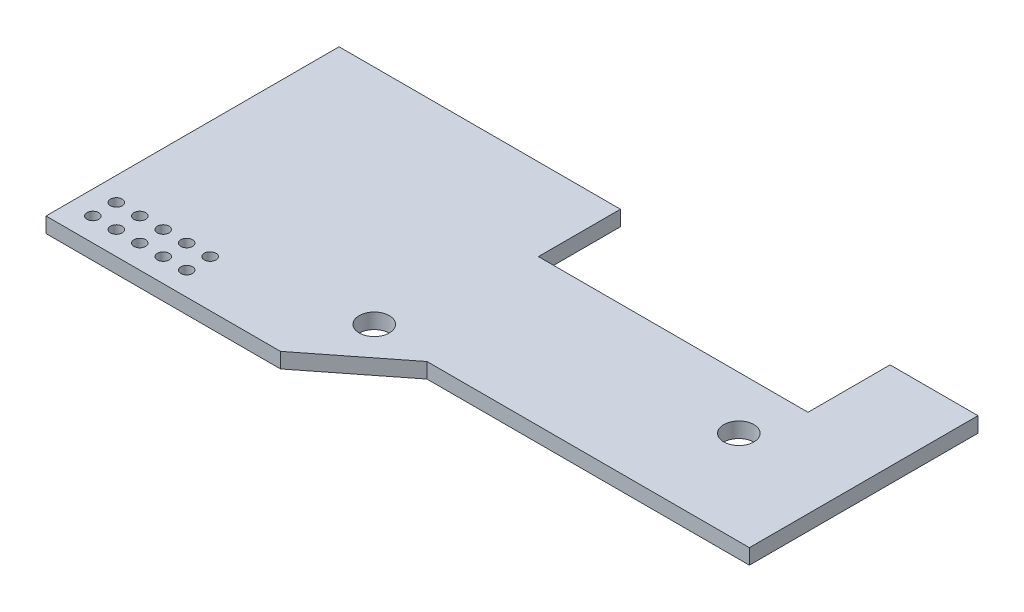
ISO-10303-21;
HEADER;
FILE_DESCRIPTION(('STEP AP214'),'2;1');
FILE_NAME('part.step','',(''),(''),'','','');
FILE_SCHEMA(('AUTOMOTIVE_DESIGN { 1 0 10303 214 1 1 1 1 }'));
ENDSEC;
DATA;
#1=APPLICATION_CONTEXT('core data for automotive mechanical design processes');
#2=APPLICATION_PROTOCOL_DEFINITION('international standard','automotive_design',2000,#1);
#3=PRODUCT_CONTEXT('',#1,'mechanical');
#4=PRODUCT('Part','Part','',(#3));
#5=PRODUCT_RELATED_PRODUCT_CATEGORY('part','',(#4));
#6=PRODUCT_DEFINITION_FORMATION('','',#4);
#7=PRODUCT_DEFINITION_CONTEXT('part definition',#1,'design');
#8=PRODUCT_DEFINITION('design','',#6,#7);
#9=PRODUCT_DEFINITION_SHAPE('','',#8);
#10=(LENGTH_UNIT() NAMED_UNIT(*) SI_UNIT(.MILLI.,.METRE.));
#11=(NAMED_UNIT(*) PLANE_ANGLE_UNIT() SI_UNIT($,.RADIAN.));
#12=(NAMED_UNIT(*) SI_UNIT($,.STERADIAN.) SOLID_ANGLE_UNIT());
#13=UNCERTAINTY_MEASURE_WITH_UNIT(LENGTH_MEASURE(1.E-05),#10,'distance_accuracy_value','');
#14=(GEOMETRIC_REPRESENTATION_CONTEXT(3) GLOBAL_UNCERTAINTY_ASSIGNED_CONTEXT((#13)) GLOBAL_UNIT_ASSIGNED_CONTEXT((#10,
#11,#12)) REPRESENTATION_CONTEXT('',''));
#15=CARTESIAN_POINT('',(0.,0.,0.));
#16=DIRECTION('',(0.,0.,1.));
#17=DIRECTION('',(1.,0.,0.));
#18=AXIS2_PLACEMENT_3D('',#15,#16,#17);
#19=CARTESIAN_POINT('',(0.,1.651,0.));
#20=DIRECTION('',(1.,0.,0.));
#21=DIRECTION('',(0.,0.,-1.));
#22=AXIS2_PLACEMENT_3D('',#19,#20,#21);
#23=PLANE('',#22);
#24=DIRECTION('',(0.,0.,1.));
#25=VECTOR('',#24,1.);
#26=CARTESIAN_POINT('',(0.,0.,0.));
#27=LINE('',#26,#25);
#28=CARTESIAN_POINT('',(0.,0.,0.));
#29=VERTEX_POINT('',#28);
#30=CARTESIAN_POINT('',(0.,0.,31.75));
#31=VERTEX_POINT('',#30);
#32=EDGE_CURVE('E142',#29,#31,#27,.T.);
#33=ORIENTED_EDGE('',*,*,#32,.T.);
#34=DIRECTION('',(0.,-1.,0.));
#35=VECTOR('',#34,1.);
#36=CARTESIAN_POINT('',(0.,1.651,31.75));
#37=LINE('',#36,#35);
#38=CARTESIAN_POINT('',(0.,1.651,31.75));
#39=VERTEX_POINT('',#38);
#40=EDGE_CURVE('E11',#39,#31,#37,.T.);
#41=ORIENTED_EDGE('',*,*,#40,.F.);
#42=DIRECTION('',(0.,0.,1.));
#43=VECTOR('',#42,1.);
#44=CARTESIAN_POINT('',(0.,1.651,0.));
#45=LINE('',#44,#43);
#46=CARTESIAN_POINT('',(0.,1.651,0.));
#47=VERTEX_POINT('',#46);
#48=EDGE_CURVE('E163',#47,#39,#45,.T.);
#49=ORIENTED_EDGE('',*,*,#48,.F.);
#50=DIRECTION('',(0.,-1.,0.));
#51=VECTOR('',#50,1.);
#52=CARTESIAN_POINT('',(0.,1.651,0.));
#53=LINE('',#52,#51);
#54=EDGE_CURVE('E138',#47,#29,#53,.T.);
#55=ORIENTED_EDGE('',*,*,#54,.T.);
#56=EDGE_LOOP('',(#33,#41,#49,#55));
#57=FACE_BOUND('',#56,.T.);
#58=ADVANCED_FACE('F35',(#57),#23,.F.);
#59=CARTESIAN_POINT('',(0.,1.651,31.75));
#60=DIRECTION('',(0.,0.,-1.));
#61=DIRECTION('',(-1.,0.,0.));
#62=AXIS2_PLACEMENT_3D('',#59,#60,#61);
#63=PLANE('',#62);
#64=DIRECTION('',(1.,0.,0.));
#65=VECTOR('',#64,1.);
#66=CARTESIAN_POINT('',(0.,0.,31.75));
#67=LINE('',#66,#65);
#68=CARTESIAN_POINT('',(25.4,0.,31.75));
#69=VERTEX_POINT('',#68);
#70=EDGE_CURVE('E145',#31,#69,#67,.T.);
#71=ORIENTED_EDGE('',*,*,#70,.T.);
#72=DIRECTION('',(0.,-1.,0.));
#73=VECTOR('',#72,1.);
#74=CARTESIAN_POINT('',(25.4,1.651,31.75));
#75=LINE('',#74,#73);
#76=CARTESIAN_POINT('',(25.4,1.651,31.75));
#77=VERTEX_POINT('',#76);
#78=EDGE_CURVE('E43',#77,#69,#75,.T.);
#79=ORIENTED_EDGE('',*,*,#78,.F.);
#80=DIRECTION('',(1.,0.,0.));
#81=VECTOR('',#80,1.);
#82=CARTESIAN_POINT('',(0.,1.651,31.75));
#83=LINE('',#82,#81);
#84=EDGE_CURVE('E100',#39,#77,#83,.T.);
#85=ORIENTED_EDGE('',*,*,#84,.F.);
#86=ORIENTED_EDGE('',*,*,#40,.T.);
#87=EDGE_LOOP('',(#71,#79,#85,#86));
#88=FACE_BOUND('',#87,.T.);
#89=ADVANCED_FACE('F325',(#88),#63,.F.);
#90=CARTESIAN_POINT('',(34.29,1.651,24.765));
#91=DIRECTION('',(-0.617821551931904,0.,-0.786318338822423));
#92=DIRECTION('',(-0.786318338822423,0.,0.617821551931904));
#93=AXIS2_PLACEMENT_3D('',#90,#91,#92);
#94=PLANE('',#93);
#95=DIRECTION('',(0.786318338822423,0.,-0.617821551931904));
#96=VECTOR('',#95,1.);
#97=CARTESIAN_POINT('',(34.29,0.,24.765));
#98=LINE('',#97,#96);
#99=CARTESIAN_POINT('',(34.29,0.,24.765));
#100=VERTEX_POINT('',#99);
#101=EDGE_CURVE('E148',#69,#100,#98,.T.);
#102=ORIENTED_EDGE('',*,*,#101,.T.);
#103=DIRECTION('',(0.,-1.,0.));
#104=VECTOR('',#103,1.);
#105=CARTESIAN_POINT('',(34.29,1.651,24.765));
#106=LINE('',#105,#104);
#107=CARTESIAN_POINT('',(34.29,1.651,24.765));
#108=VERTEX_POINT('',#107);
#109=EDGE_CURVE('E176',#108,#100,#106,.T.);
#110=ORIENTED_EDGE('',*,*,#109,.F.);
#111=DIRECTION('',(0.786318338822423,0.,-0.617821551931904));
#112=VECTOR('',#111,1.);
#113=CARTESIAN_POINT('',(34.29,1.651,24.765));
#114=LINE('',#113,#112);
#115=EDGE_CURVE('E184',#77,#108,#114,.T.);
#116=ORIENTED_EDGE('',*,*,#115,.F.);
#117=ORIENTED_EDGE('',*,*,#78,.T.);
#118=EDGE_LOOP('',(#102,#110,#116,#117));
#119=FACE_BOUND('',#118,.T.);
#120=ADVANCED_FACE('F182',(#119),#94,.F.);
#121=CARTESIAN_POINT('',(69.215,1.651,24.765));
#122=DIRECTION('',(0.,0.,-1.));
#123=DIRECTION('',(-1.,0.,0.));
#124=AXIS2_PLACEMENT_3D('',#121,#122,#123);
#125=PLANE('',#124);
#126=DIRECTION('',(1.,0.,0.));
#127=VECTOR('',#126,1.);
#128=CARTESIAN_POINT('',(69.215,0.,24.765));
#129=LINE('',#128,#127);
#130=CARTESIAN_POINT('',(69.215,0.,24.765));
#131=VERTEX_POINT('',#130);
#132=EDGE_CURVE('E151',#100,#131,#129,.T.);
#133=ORIENTED_EDGE('',*,*,#132,.T.);
#134=DIRECTION('',(0.,-1.,0.));
#135=VECTOR('',#134,1.);
#136=CARTESIAN_POINT('',(69.215,1.651,24.765));
#137=LINE('',#136,#135);
#138=CARTESIAN_POINT('',(69.215,1.651,24.765));
#139=VERTEX_POINT('',#138);
#140=EDGE_CURVE('E173',#139,#131,#137,.T.);
#141=ORIENTED_EDGE('',*,*,#140,.F.);
#142=DIRECTION('',(1.,0.,0.));
#143=VECTOR('',#142,1.);
#144=CARTESIAN_POINT('',(34.29,1.651,24.765));
#145=LINE('',#144,#143);
#146=EDGE_CURVE('E201',#108,#139,#145,.T.);
#147=ORIENTED_EDGE('',*,*,#146,.F.);
#148=ORIENTED_EDGE('',*,*,#109,.T.);
#149=EDGE_LOOP('',(#133,#141,#147,#148));
#150=FACE_BOUND('',#149,.T.);
#151=ADVANCED_FACE('F192',(#150),#125,.F.);
#152=CARTESIAN_POINT('',(69.215,1.651,0.));
#153=DIRECTION('',(-1.,0.,0.));
#154=DIRECTION('',(0.,0.,1.));
#155=AXIS2_PLACEMENT_3D('',#152,#153,#154);
#156=PLANE('',#155);
#157=DIRECTION('',(0.,0.,-1.));
#158=VECTOR('',#157,1.);
#159=CARTESIAN_POINT('',(69.215,0.,0.));
#160=LINE('',#159,#158);
#161=CARTESIAN_POINT('',(69.215,0.,0.));
#162=VERTEX_POINT('',#161);
#163=EDGE_CURVE('E153',#131,#162,#160,.T.);
#164=ORIENTED_EDGE('',*,*,#163,.T.);
#165=DIRECTION('',(0.,-1.,0.));
#166=VECTOR('',#165,1.);
#167=CARTESIAN_POINT('',(69.215,1.651,0.));
#168=LINE('',#167,#166);
#169=CARTESIAN_POINT('',(69.215,1.651,0.));
#170=VERTEX_POINT('',#169);
#171=EDGE_CURVE('E170',#170,#162,#168,.T.);
#172=ORIENTED_EDGE('',*,*,#171,.F.);
#173=DIRECTION('',(0.,0.,-1.));
#174=VECTOR('',#173,1.);
#175=CARTESIAN_POINT('',(69.215,1.651,0.));
#176=LINE('',#175,#174);
#177=EDGE_CURVE('E198',#139,#170,#176,.T.);
#178=ORIENTED_EDGE('',*,*,#177,.F.);
#179=ORIENTED_EDGE('',*,*,#140,.T.);
#180=EDGE_LOOP('',(#164,#172,#178,#179));
#181=FACE_BOUND('',#180,.T.);
#182=ADVANCED_FACE('F196',(#181),#156,.F.);
#183=CARTESIAN_POINT('',(59.69,1.651,0.));
#184=DIRECTION('',(0.,0.,1.));
#185=DIRECTION('',(1.,0.,0.));
#186=AXIS2_PLACEMENT_3D('',#183,#184,#185);
#187=PLANE('',#186);
#188=DIRECTION('',(-1.,0.,0.));
#189=VECTOR('',#188,1.);
#190=CARTESIAN_POINT('',(59.69,0.,0.));
#191=LINE('',#190,#189);
#192=CARTESIAN_POINT('',(59.69,0.,0.));
#193=VERTEX_POINT('',#192);
#194=EDGE_CURVE('E155',#162,#193,#191,.T.);
#195=ORIENTED_EDGE('',*,*,#194,.T.);
#196=DIRECTION('',(0.,-1.,0.));
#197=VECTOR('',#196,1.);
#198=CARTESIAN_POINT('',(59.69,1.651,0.));
#199=LINE('',#198,#197);
#200=CARTESIAN_POINT('',(59.69,1.651,0.));
#201=VERTEX_POINT('',#200);
#202=EDGE_CURVE('E167',#201,#193,#199,.T.);
#203=ORIENTED_EDGE('',*,*,#202,.F.);
#204=DIRECTION('',(-1.,0.,0.));
#205=VECTOR('',#204,1.);
#206=CARTESIAN_POINT('',(59.69,1.651,0.));
#207=LINE('',#206,#205);
#208=EDGE_CURVE('E200',#170,#201,#207,.T.);
#209=ORIENTED_EDGE('',*,*,#208,.F.);
#210=ORIENTED_EDGE('',*,*,#171,.T.);
#211=EDGE_LOOP('',(#195,#203,#209,#210));
#212=FACE_BOUND('',#211,.T.);
#213=ADVANCED_FACE('F337',(#212),#187,.F.);
#214=CARTESIAN_POINT('',(59.69,1.651,8.89));
#215=DIRECTION('',(1.,0.,0.));
#216=DIRECTION('',(0.,0.,-1.));
#217=AXIS2_PLACEMENT_3D('',#214,#215,#216);
#218=PLANE('',#217);
#219=DIRECTION('',(0.,0.,1.));
#220=VECTOR('',#219,1.);
#221=CARTESIAN_POINT('',(59.69,0.,8.89));
#222=LINE('',#221,#220);
#223=CARTESIAN_POINT('',(59.69,0.,8.89));
#224=VERTEX_POINT('',#223);
#225=EDGE_CURVE('E157',#193,#224,#222,.T.);
#226=ORIENTED_EDGE('',*,*,#225,.T.);
#227=DIRECTION('',(0.,-1.,0.));
#228=VECTOR('',#227,1.);
#229=CARTESIAN_POINT('',(59.69,1.651,8.89));
#230=LINE('',#229,#228);
#231=CARTESIAN_POINT('',(59.69,1.651,8.89));
#232=VERTEX_POINT('',#231);
#233=EDGE_CURVE('E133',#232,#224,#230,.T.);
#234=ORIENTED_EDGE('',*,*,#233,.F.);
#235=DIRECTION('',(0.,0.,1.));
#236=VECTOR('',#235,1.);
#237=CARTESIAN_POINT('',(59.69,1.651,8.89));
#238=LINE('',#237,#236);
#239=EDGE_CURVE('E125',#201,#232,#238,.T.);
#240=ORIENTED_EDGE('',*,*,#239,.F.);
#241=ORIENTED_EDGE('',*,*,#202,.T.);
#242=EDGE_LOOP('',(#226,#234,#240,#241));
#243=FACE_BOUND('',#242,.T.);
#244=ADVANCED_FACE('F334',(#243),#218,.F.);
#245=CARTESIAN_POINT('',(45.085,1.651,8.89));
#246=DIRECTION('',(0.,0.,1.));
#247=DIRECTION('',(1.,0.,0.));
#248=AXIS2_PLACEMENT_3D('',#245,#246,#247);
#249=PLANE('',#248);
#250=DIRECTION('',(-1.,0.,0.));
#251=VECTOR('',#250,1.);
#252=CARTESIAN_POINT('',(45.085,0.,8.89));
#253=LINE('',#252,#251);
#254=CARTESIAN_POINT('',(30.48,0.,8.89));
#255=VERTEX_POINT('',#254);
#256=EDGE_CURVE('E132',#224,#255,#253,.T.);
#257=ORIENTED_EDGE('',*,*,#256,.T.);
#258=DIRECTION('',(0.,-1.,0.));
#259=VECTOR('',#258,1.);
#260=CARTESIAN_POINT('',(30.48,1.651,8.89));
#261=LINE('',#260,#259);
#262=CARTESIAN_POINT('',(30.48,1.651,8.89));
#263=VERTEX_POINT('',#262);
#264=EDGE_CURVE('E130',#263,#255,#261,.T.);
#265=ORIENTED_EDGE('',*,*,#264,.F.);
#266=DIRECTION('',(-1.,0.,0.));
#267=VECTOR('',#266,1.);
#268=CARTESIAN_POINT('',(45.085,1.651,8.89));
#269=LINE('',#268,#267);
#270=EDGE_CURVE('E119',#232,#263,#269,.T.);
#271=ORIENTED_EDGE('',*,*,#270,.F.);
#272=ORIENTED_EDGE('',*,*,#233,.T.);
#273=EDGE_LOOP('',(#257,#265,#271,#272));
#274=FACE_BOUND('',#273,.T.);
#275=ADVANCED_FACE('F131',(#274),#249,.F.);
#276=CARTESIAN_POINT('',(30.48,1.651,0.));
#277=DIRECTION('',(-1.,0.,0.));
#278=DIRECTION('',(0.,0.,1.));
#279=AXIS2_PLACEMENT_3D('',#276,#277,#278);
#280=PLANE('',#279);
#281=DIRECTION('',(0.,0.,-1.));
#282=VECTOR('',#281,1.);
#283=CARTESIAN_POINT('',(30.48,0.,0.));
#284=LINE('',#283,#282);
#285=CARTESIAN_POINT('',(30.48,0.,0.));
#286=VERTEX_POINT('',#285);
#287=EDGE_CURVE('E86',#255,#286,#284,.T.);
#288=ORIENTED_EDGE('',*,*,#287,.T.);
#289=DIRECTION('',(0.,-1.,0.));
#290=VECTOR('',#289,1.);
#291=CARTESIAN_POINT('',(30.48,1.651,0.));
#292=LINE('',#291,#290);
#293=CARTESIAN_POINT('',(30.48,1.651,0.));
#294=VERTEX_POINT('',#293);
#295=EDGE_CURVE('E134',#294,#286,#292,.T.);
#296=ORIENTED_EDGE('',*,*,#295,.F.);
#297=DIRECTION('',(0.,0.,-1.));
#298=VECTOR('',#297,1.);
#299=CARTESIAN_POINT('',(30.48,1.651,0.));
#300=LINE('',#299,#298);
#301=EDGE_CURVE('E123',#263,#294,#300,.T.);
#302=ORIENTED_EDGE('',*,*,#301,.F.);
#303=ORIENTED_EDGE('',*,*,#264,.T.);
#304=EDGE_LOOP('',(#288,#296,#302,#303));
#305=FACE_BOUND('',#304,.T.);
#306=ADVANCED_FACE('F136',(#305),#280,.F.);
#307=CARTESIAN_POINT('',(0.,1.651,0.));
#308=DIRECTION('',(0.,0.,1.));
#309=DIRECTION('',(1.,0.,0.));
#310=AXIS2_PLACEMENT_3D('',#307,#308,#309);
#311=PLANE('',#310);
#312=DIRECTION('',(-1.,0.,0.));
#313=VECTOR('',#312,1.);
#314=CARTESIAN_POINT('',(0.,0.,0.));
#315=LINE('',#314,#313);
#316=EDGE_CURVE('E92',#286,#29,#315,.T.);
#317=ORIENTED_EDGE('',*,*,#316,.T.);
#318=ORIENTED_EDGE('',*,*,#54,.F.);
#319=DIRECTION('',(-1.,0.,0.));
#320=VECTOR('',#319,1.);
#321=CARTESIAN_POINT('',(0.,1.651,0.));
#322=LINE('',#321,#320);
#323=EDGE_CURVE('E51',#294,#47,#322,.T.);
#324=ORIENTED_EDGE('',*,*,#323,.F.);
#325=ORIENTED_EDGE('',*,*,#295,.T.);
#326=EDGE_LOOP('',(#317,#318,#324,#325));
#327=FACE_BOUND('',#326,.T.);
#328=ADVANCED_FACE('F285',(#327),#311,.F.);
#329=CARTESIAN_POINT('',(0.,1.651,31.75));
#330=DIRECTION('',(0.,1.,0.));
#331=DIRECTION('',(0.,0.,1.));
#332=AXIS2_PLACEMENT_3D('',#329,#330,#331);
#333=PLANE('',#332);
#334=CARTESIAN_POINT('',(27.94,1.651,24.13));
#335=DIRECTION('',(0.,1.,0.));
#336=DIRECTION('',(0.,0.,1.));
#337=AXIS2_PLACEMENT_3D('',#334,#335,#336);
#338=CIRCLE('',#337,1.63194999999999);
#339=CARTESIAN_POINT('',(27.94,1.651,25.76195));
#340=VERTEX_POINT('',#339);
#341=EDGE_CURVE('E277',#340,#340,#338,.T.);
#342=ORIENTED_EDGE('',*,*,#341,.F.);
#343=EDGE_LOOP('',(#342));
#344=FACE_BOUND('',#343,.T.);
#345=CARTESIAN_POINT('',(57.912,1.651,14.605));
#346=DIRECTION('',(0.,1.,0.));
#347=DIRECTION('',(0.,0.,1.));
#348=AXIS2_PLACEMENT_3D('',#345,#346,#347);
#349=CIRCLE('',#348,1.63194999999999);
#350=CARTESIAN_POINT('',(57.912,1.651,16.23695));
#351=VERTEX_POINT('',#350);
#352=EDGE_CURVE('E271',#351,#351,#349,.T.);
#353=ORIENTED_EDGE('',*,*,#352,.F.);
#354=EDGE_LOOP('',(#353));
#355=FACE_BOUND('',#354,.T.);
#356=CARTESIAN_POINT('',(12.7,1.651,26.67));
#357=DIRECTION('',(0.,1.,0.));
#358=DIRECTION('',(0.,0.,1.));
#359=AXIS2_PLACEMENT_3D('',#356,#357,#358);
#360=CIRCLE('',#359,0.635000000000008);
#361=CARTESIAN_POINT('',(12.7,1.651,27.305));
#362=VERTEX_POINT('',#361);
#363=EDGE_CURVE('E263',#362,#362,#360,.T.);
#364=ORIENTED_EDGE('',*,*,#363,.F.);
#365=EDGE_LOOP('',(#364));
#366=FACE_BOUND('',#365,.T.);
#367=CARTESIAN_POINT('',(10.16,1.651,26.67));
#368=DIRECTION('',(0.,1.,0.));
#369=DIRECTION('',(0.,0.,1.));
#370=AXIS2_PLACEMENT_3D('',#367,#368,#369);
#371=CIRCLE('',#370,0.635000000000004);
#372=CARTESIAN_POINT('',(10.16,1.651,27.305));
#373=VERTEX_POINT('',#372);
#374=EDGE_CURVE('E257',#373,#373,#371,.T.);
#375=ORIENTED_EDGE('',*,*,#374,.F.);
#376=EDGE_LOOP('',(#375));
#377=FACE_BOUND('',#376,.T.);
#378=CARTESIAN_POINT('',(7.62,1.651,26.67));
#379=DIRECTION('',(0.,1.,0.));
#380=DIRECTION('',(0.,0.,1.));
#381=AXIS2_PLACEMENT_3D('',#378,#379,#380);
#382=CIRCLE('',#381,0.635000000000009);
#383=CARTESIAN_POINT('',(7.62,1.651,27.305));
#384=VERTEX_POINT('',#383);
#385=EDGE_CURVE('E251',#384,#384,#382,.T.);
#386=ORIENTED_EDGE('',*,*,#385,.F.);
#387=EDGE_LOOP('',(#386));
#388=FACE_BOUND('',#387,.T.);
#389=CARTESIAN_POINT('',(5.08,1.651,26.67));
#390=DIRECTION('',(0.,1.,0.));
#391=DIRECTION('',(0.,0.,1.));
#392=AXIS2_PLACEMENT_3D('',#389,#390,#391);
#393=CIRCLE('',#392,0.634999999999999);
#394=CARTESIAN_POINT('',(5.08,1.651,27.305));
#395=VERTEX_POINT('',#394);
#396=EDGE_CURVE('E245',#395,#395,#393,.T.);
#397=ORIENTED_EDGE('',*,*,#396,.F.);
#398=EDGE_LOOP('',(#397));
#399=FACE_BOUND('',#398,.T.);
#400=CARTESIAN_POINT('',(2.53999999999999,1.651,26.67));
#401=DIRECTION('',(0.,1.,0.));
#402=DIRECTION('',(0.,0.,1.));
#403=AXIS2_PLACEMENT_3D('',#400,#401,#402);
#404=CIRCLE('',#403,0.635000000000007);
#405=CARTESIAN_POINT('',(2.53999999999999,1.651,27.305));
#406=VERTEX_POINT('',#405);
#407=EDGE_CURVE('E239',#406,#406,#404,.T.);
#408=ORIENTED_EDGE('',*,*,#407,.F.);
#409=EDGE_LOOP('',(#408));
#410=FACE_BOUND('',#409,.T.);
#411=CARTESIAN_POINT('',(12.7,1.651,29.21));
#412=DIRECTION('',(0.,1.,0.));
#413=DIRECTION('',(0.,0.,1.));
#414=AXIS2_PLACEMENT_3D('',#411,#412,#413);
#415=CIRCLE('',#414,0.635000000000008);
#416=CARTESIAN_POINT('',(12.7,1.651,29.845));
#417=VERTEX_POINT('',#416);
#418=EDGE_CURVE('E233',#417,#417,#415,.T.);
#419=ORIENTED_EDGE('',*,*,#418,.F.);
#420=EDGE_LOOP('',(#419));
#421=FACE_BOUND('',#420,.T.);
#422=CARTESIAN_POINT('',(10.16,1.651,29.21));
#423=DIRECTION('',(0.,1.,0.));
#424=DIRECTION('',(0.,0.,1.));
#425=AXIS2_PLACEMENT_3D('',#422,#423,#424);
#426=CIRCLE('',#425,0.635000000000008);
#427=CARTESIAN_POINT('',(10.16,1.651,29.845));
#428=VERTEX_POINT('',#427);
#429=EDGE_CURVE('E227',#428,#428,#426,.T.);
#430=ORIENTED_EDGE('',*,*,#429,.F.);
#431=EDGE_LOOP('',(#430));
#432=FACE_BOUND('',#431,.T.);
#433=CARTESIAN_POINT('',(7.62,1.651,29.21));
#434=DIRECTION('',(0.,1.,0.));
#435=DIRECTION('',(0.,0.,1.));
#436=AXIS2_PLACEMENT_3D('',#433,#434,#435);
#437=CIRCLE('',#436,0.635000000000008);
#438=CARTESIAN_POINT('',(7.62,1.651,29.845));
#439=VERTEX_POINT('',#438);
#440=EDGE_CURVE('E221',#439,#439,#437,.T.);
#441=ORIENTED_EDGE('',*,*,#440,.F.);
#442=EDGE_LOOP('',(#441));
#443=FACE_BOUND('',#442,.T.);
#444=CARTESIAN_POINT('',(5.08,1.651,29.21));
#445=DIRECTION('',(0.,1.,0.));
#446=DIRECTION('',(0.,0.,1.));
#447=AXIS2_PLACEMENT_3D('',#444,#445,#446);
#448=CIRCLE('',#447,0.635000000000003);
#449=CARTESIAN_POINT('',(5.08,1.651,29.845));
#450=VERTEX_POINT('',#449);
#451=EDGE_CURVE('E215',#450,#450,#448,.T.);
#452=ORIENTED_EDGE('',*,*,#451,.F.);
#453=EDGE_LOOP('',(#452));
#454=FACE_BOUND('',#453,.T.);
#455=CARTESIAN_POINT('',(2.53999999999999,1.651,29.21));
#456=DIRECTION('',(0.,1.,0.));
#457=DIRECTION('',(0.,0.,1.));
#458=AXIS2_PLACEMENT_3D('',#455,#456,#457);
#459=CIRCLE('',#458,0.635000000000004);
#460=CARTESIAN_POINT('',(2.53999999999999,1.651,29.845));
#461=VERTEX_POINT('',#460);
#462=EDGE_CURVE('E209',#461,#461,#459,.T.);
#463=ORIENTED_EDGE('',*,*,#462,.F.);
#464=EDGE_LOOP('',(#463));
#465=FACE_BOUND('',#464,.T.);
#466=ORIENTED_EDGE('',*,*,#48,.T.);
#467=ORIENTED_EDGE('',*,*,#84,.T.);
#468=ORIENTED_EDGE('',*,*,#115,.T.);
#469=ORIENTED_EDGE('',*,*,#146,.T.);
#470=ORIENTED_EDGE('',*,*,#177,.T.);
#471=ORIENTED_EDGE('',*,*,#208,.T.);
#472=ORIENTED_EDGE('',*,*,#239,.T.);
#473=ORIENTED_EDGE('',*,*,#270,.T.);
#474=ORIENTED_EDGE('',*,*,#301,.T.);
#475=ORIENTED_EDGE('',*,*,#323,.T.);
#476=EDGE_LOOP('',(#466,#467,#468,#469,#470,#471,#472,#473,#474,#475));
#477=FACE_BOUND('',#476,.T.);
#478=ADVANCED_FACE('F121',(#344,#355,#366,#377,#388,#399,#410,#421,#432,#443,#454,#465,#477),
#333,.T.);
#479=CARTESIAN_POINT('',(0.,0.,31.75));
#480=DIRECTION('',(0.,1.,0.));
#481=DIRECTION('',(0.,0.,1.));
#482=AXIS2_PLACEMENT_3D('',#479,#480,#481);
#483=PLANE('',#482);
#484=CARTESIAN_POINT('',(27.94,0.,24.13));
#485=DIRECTION('',(0.,1.,0.));
#486=DIRECTION('',(0.,0.,1.));
#487=AXIS2_PLACEMENT_3D('',#484,#485,#486);
#488=CIRCLE('',#487,1.63195);
#489=CARTESIAN_POINT('',(27.94,0.,25.76195));
#490=VERTEX_POINT('',#489);
#491=EDGE_CURVE('E274',#490,#490,#488,.T.);
#492=ORIENTED_EDGE('',*,*,#491,.T.);
#493=EDGE_LOOP('',(#492));
#494=FACE_BOUND('',#493,.T.);
#495=CARTESIAN_POINT('',(57.912,0.,14.605));
#496=DIRECTION('',(0.,1.,0.));
#497=DIRECTION('',(0.,0.,1.));
#498=AXIS2_PLACEMENT_3D('',#495,#496,#497);
#499=CIRCLE('',#498,1.63195);
#500=CARTESIAN_POINT('',(57.912,0.,16.23695));
#501=VERTEX_POINT('',#500);
#502=EDGE_CURVE('E266',#501,#501,#499,.T.);
#503=ORIENTED_EDGE('',*,*,#502,.T.);
#504=EDGE_LOOP('',(#503));
#505=FACE_BOUND('',#504,.T.);
#506=CARTESIAN_POINT('',(12.7,0.,26.67));
#507=DIRECTION('',(0.,1.,0.));
#508=DIRECTION('',(0.,0.,1.));
#509=AXIS2_PLACEMENT_3D('',#506,#507,#508);
#510=CIRCLE('',#509,0.635000000000008);
#511=CARTESIAN_POINT('',(12.7,0.,27.305));
#512=VERTEX_POINT('',#511);
#513=EDGE_CURVE('E260',#512,#512,#510,.T.);
#514=ORIENTED_EDGE('',*,*,#513,.T.);
#515=EDGE_LOOP('',(#514));
#516=FACE_BOUND('',#515,.T.);
#517=CARTESIAN_POINT('',(10.16,0.,26.67));
#518=DIRECTION('',(0.,1.,0.));
#519=DIRECTION('',(0.,0.,1.));
#520=AXIS2_PLACEMENT_3D('',#517,#518,#519);
#521=CIRCLE('',#520,0.635000000000004);
#522=CARTESIAN_POINT('',(10.16,0.,27.305));
#523=VERTEX_POINT('',#522);
#524=EDGE_CURVE('E254',#523,#523,#521,.T.);
#525=ORIENTED_EDGE('',*,*,#524,.T.);
#526=EDGE_LOOP('',(#525));
#527=FACE_BOUND('',#526,.T.);
#528=CARTESIAN_POINT('',(7.62,0.,26.67));
#529=DIRECTION('',(0.,1.,0.));
#530=DIRECTION('',(0.,0.,1.));
#531=AXIS2_PLACEMENT_3D('',#528,#529,#530);
#532=CIRCLE('',#531,0.635000000000009);
#533=CARTESIAN_POINT('',(7.62,0.,27.305));
#534=VERTEX_POINT('',#533);
#535=EDGE_CURVE('E248',#534,#534,#532,.T.);
#536=ORIENTED_EDGE('',*,*,#535,.T.);
#537=EDGE_LOOP('',(#536));
#538=FACE_BOUND('',#537,.T.);
#539=CARTESIAN_POINT('',(5.08,0.,26.67));
#540=DIRECTION('',(0.,1.,0.));
#541=DIRECTION('',(0.,0.,1.));
#542=AXIS2_PLACEMENT_3D('',#539,#540,#541);
#543=CIRCLE('',#542,0.634999999999999);
#544=CARTESIAN_POINT('',(5.08,0.,27.305));
#545=VERTEX_POINT('',#544);
#546=EDGE_CURVE('E242',#545,#545,#543,.T.);
#547=ORIENTED_EDGE('',*,*,#546,.T.);
#548=EDGE_LOOP('',(#547));
#549=FACE_BOUND('',#548,.T.);
#550=CARTESIAN_POINT('',(2.53999999999999,0.,26.67));
#551=DIRECTION('',(0.,1.,0.));
#552=DIRECTION('',(0.,0.,1.));
#553=AXIS2_PLACEMENT_3D('',#550,#551,#552);
#554=CIRCLE('',#553,0.635000000000007);
#555=CARTESIAN_POINT('',(2.53999999999999,0.,27.305));
#556=VERTEX_POINT('',#555);
#557=EDGE_CURVE('E236',#556,#556,#554,.T.);
#558=ORIENTED_EDGE('',*,*,#557,.T.);
#559=EDGE_LOOP('',(#558));
#560=FACE_BOUND('',#559,.T.);
#561=CARTESIAN_POINT('',(12.7,0.,29.21));
#562=DIRECTION('',(0.,1.,0.));
#563=DIRECTION('',(0.,0.,1.));
#564=AXIS2_PLACEMENT_3D('',#561,#562,#563);
#565=CIRCLE('',#564,0.635000000000008);
#566=CARTESIAN_POINT('',(12.7,0.,29.845));
#567=VERTEX_POINT('',#566);
#568=EDGE_CURVE('E230',#567,#567,#565,.T.);
#569=ORIENTED_EDGE('',*,*,#568,.T.);
#570=EDGE_LOOP('',(#569));
#571=FACE_BOUND('',#570,.T.);
#572=CARTESIAN_POINT('',(10.16,0.,29.21));
#573=DIRECTION('',(0.,1.,0.));
#574=DIRECTION('',(0.,0.,1.));
#575=AXIS2_PLACEMENT_3D('',#572,#573,#574);
#576=CIRCLE('',#575,0.635000000000008);
#577=CARTESIAN_POINT('',(10.16,0.,29.845));
#578=VERTEX_POINT('',#577);
#579=EDGE_CURVE('E224',#578,#578,#576,.T.);
#580=ORIENTED_EDGE('',*,*,#579,.T.);
#581=EDGE_LOOP('',(#580));
#582=FACE_BOUND('',#581,.T.);
#583=CARTESIAN_POINT('',(7.62,0.,29.21));
#584=DIRECTION('',(0.,1.,0.));
#585=DIRECTION('',(0.,0.,1.));
#586=AXIS2_PLACEMENT_3D('',#583,#584,#585);
#587=CIRCLE('',#586,0.635000000000008);
#588=CARTESIAN_POINT('',(7.62,0.,29.845));
#589=VERTEX_POINT('',#588);
#590=EDGE_CURVE('E218',#589,#589,#587,.T.);
#591=ORIENTED_EDGE('',*,*,#590,.T.);
#592=EDGE_LOOP('',(#591));
#593=FACE_BOUND('',#592,.T.);
#594=CARTESIAN_POINT('',(5.08,0.,29.21));
#595=DIRECTION('',(0.,1.,0.));
#596=DIRECTION('',(0.,0.,1.));
#597=AXIS2_PLACEMENT_3D('',#594,#595,#596);
#598=CIRCLE('',#597,0.635000000000003);
#599=CARTESIAN_POINT('',(5.08,0.,29.845));
#600=VERTEX_POINT('',#599);
#601=EDGE_CURVE('E212',#600,#600,#598,.T.);
#602=ORIENTED_EDGE('',*,*,#601,.T.);
#603=EDGE_LOOP('',(#602));
#604=FACE_BOUND('',#603,.T.);
#605=CARTESIAN_POINT('',(2.53999999999999,0.,29.21));
#606=DIRECTION('',(0.,1.,0.));
#607=DIRECTION('',(0.,0.,1.));
#608=AXIS2_PLACEMENT_3D('',#605,#606,#607);
#609=CIRCLE('',#608,0.635000000000004);
#610=CARTESIAN_POINT('',(2.53999999999999,0.,29.845));
#611=VERTEX_POINT('',#610);
#612=EDGE_CURVE('E146',#611,#611,#609,.T.);
#613=ORIENTED_EDGE('',*,*,#612,.T.);
#614=EDGE_LOOP('',(#613));
#615=FACE_BOUND('',#614,.T.);
#616=ORIENTED_EDGE('',*,*,#32,.F.);
#617=ORIENTED_EDGE('',*,*,#316,.F.);
#618=ORIENTED_EDGE('',*,*,#287,.F.);
#619=ORIENTED_EDGE('',*,*,#256,.F.);
#620=ORIENTED_EDGE('',*,*,#225,.F.);
#621=ORIENTED_EDGE('',*,*,#194,.F.);
#622=ORIENTED_EDGE('',*,*,#163,.F.);
#623=ORIENTED_EDGE('',*,*,#132,.F.);
#624=ORIENTED_EDGE('',*,*,#101,.F.);
#625=ORIENTED_EDGE('',*,*,#70,.F.);
#626=EDGE_LOOP('',(#616,#617,#618,#619,#620,#621,#622,#623,#624,#625));
#627=FACE_BOUND('',#626,.T.);
#628=ADVANCED_FACE('F187',(#494,#505,#516,#527,#538,#549,#560,#571,#582,#593,#604,#615,#627),
#483,.F.);
#629=CARTESIAN_POINT('',(2.53999999999999,0.,29.21));
#630=DIRECTION('',(0.,1.,0.));
#631=DIRECTION('',(0.,0.,1.));
#632=AXIS2_PLACEMENT_3D('',#629,#630,#631);
#633=CYLINDRICAL_SURFACE('',#632,0.635000000000004);
#634=ORIENTED_EDGE('',*,*,#612,.F.);
#635=EDGE_LOOP('',(#634));
#636=FACE_BOUND('',#635,.T.);
#637=ORIENTED_EDGE('',*,*,#462,.T.);
#638=EDGE_LOOP('',(#637));
#639=FACE_BOUND('',#638,.T.);
#640=ADVANCED_FACE('F309',(#636,#639),#633,.F.);
#641=CARTESIAN_POINT('',(5.08,0.,29.21));
#642=DIRECTION('',(0.,1.,0.));
#643=DIRECTION('',(0.,0.,1.));
#644=AXIS2_PLACEMENT_3D('',#641,#642,#643);
#645=CYLINDRICAL_SURFACE('',#644,0.635000000000003);
#646=ORIENTED_EDGE('',*,*,#601,.F.);
#647=EDGE_LOOP('',(#646));
#648=FACE_BOUND('',#647,.T.);
#649=ORIENTED_EDGE('',*,*,#451,.T.);
#650=EDGE_LOOP('',(#649));
#651=FACE_BOUND('',#650,.T.);
#652=ADVANCED_FACE('F311',(#648,#651),#645,.F.);
#653=CARTESIAN_POINT('',(7.62,0.,29.21));
#654=DIRECTION('',(0.,1.,0.));
#655=DIRECTION('',(0.,0.,1.));
#656=AXIS2_PLACEMENT_3D('',#653,#654,#655);
#657=CYLINDRICAL_SURFACE('',#656,0.635000000000008);
#658=ORIENTED_EDGE('',*,*,#590,.F.);
#659=EDGE_LOOP('',(#658));
#660=FACE_BOUND('',#659,.T.);
#661=ORIENTED_EDGE('',*,*,#440,.T.);
#662=EDGE_LOOP('',(#661));
#663=FACE_BOUND('',#662,.T.);
#664=ADVANCED_FACE('F318',(#660,#663),#657,.F.);
#665=CARTESIAN_POINT('',(10.16,0.,29.21));
#666=DIRECTION('',(0.,1.,0.));
#667=DIRECTION('',(0.,0.,1.));
#668=AXIS2_PLACEMENT_3D('',#665,#666,#667);
#669=CYLINDRICAL_SURFACE('',#668,0.635000000000008);
#670=ORIENTED_EDGE('',*,*,#579,.F.);
#671=EDGE_LOOP('',(#670));
#672=FACE_BOUND('',#671,.T.);
#673=ORIENTED_EDGE('',*,*,#429,.T.);
#674=EDGE_LOOP('',(#673));
#675=FACE_BOUND('',#674,.T.);
#676=ADVANCED_FACE('F418',(#672,#675),#669,.F.);
#677=CARTESIAN_POINT('',(12.7,0.,29.21));
#678=DIRECTION('',(0.,1.,0.));
#679=DIRECTION('',(0.,0.,1.));
#680=AXIS2_PLACEMENT_3D('',#677,#678,#679);
#681=CYLINDRICAL_SURFACE('',#680,0.635000000000008);
#682=ORIENTED_EDGE('',*,*,#568,.F.);
#683=EDGE_LOOP('',(#682));
#684=FACE_BOUND('',#683,.T.);
#685=ORIENTED_EDGE('',*,*,#418,.T.);
#686=EDGE_LOOP('',(#685));
#687=FACE_BOUND('',#686,.T.);
#688=ADVANCED_FACE('F428',(#684,#687),#681,.F.);
#689=CARTESIAN_POINT('',(2.53999999999999,0.,26.67));
#690=DIRECTION('',(0.,1.,0.));
#691=DIRECTION('',(0.,0.,1.));
#692=AXIS2_PLACEMENT_3D('',#689,#690,#691);
#693=CYLINDRICAL_SURFACE('',#692,0.635000000000007);
#694=ORIENTED_EDGE('',*,*,#557,.F.);
#695=EDGE_LOOP('',(#694));
#696=FACE_BOUND('',#695,.T.);
#697=ORIENTED_EDGE('',*,*,#407,.T.);
#698=EDGE_LOOP('',(#697));
#699=FACE_BOUND('',#698,.T.);
#700=ADVANCED_FACE('F438',(#696,#699),#693,.F.);
#701=CARTESIAN_POINT('',(5.08,0.,26.67));
#702=DIRECTION('',(0.,1.,0.));
#703=DIRECTION('',(0.,0.,1.));
#704=AXIS2_PLACEMENT_3D('',#701,#702,#703);
#705=CYLINDRICAL_SURFACE('',#704,0.634999999999999);
#706=ORIENTED_EDGE('',*,*,#546,.F.);
#707=EDGE_LOOP('',(#706));
#708=FACE_BOUND('',#707,.T.);
#709=ORIENTED_EDGE('',*,*,#396,.T.);
#710=EDGE_LOOP('',(#709));
#711=FACE_BOUND('',#710,.T.);
#712=ADVANCED_FACE('F448',(#708,#711),#705,.F.);
#713=CARTESIAN_POINT('',(7.62,0.,26.67));
#714=DIRECTION('',(0.,1.,0.));
#715=DIRECTION('',(0.,0.,1.));
#716=AXIS2_PLACEMENT_3D('',#713,#714,#715);
#717=CYLINDRICAL_SURFACE('',#716,0.635000000000009);
#718=ORIENTED_EDGE('',*,*,#535,.F.);
#719=EDGE_LOOP('',(#718));
#720=FACE_BOUND('',#719,.T.);
#721=ORIENTED_EDGE('',*,*,#385,.T.);
#722=EDGE_LOOP('',(#721));
#723=FACE_BOUND('',#722,.T.);
#724=ADVANCED_FACE('F458',(#720,#723),#717,.F.);
#725=CARTESIAN_POINT('',(10.16,0.,26.67));
#726=DIRECTION('',(0.,1.,0.));
#727=DIRECTION('',(0.,0.,1.));
#728=AXIS2_PLACEMENT_3D('',#725,#726,#727);
#729=CYLINDRICAL_SURFACE('',#728,0.635000000000004);
#730=ORIENTED_EDGE('',*,*,#524,.F.);
#731=EDGE_LOOP('',(#730));
#732=FACE_BOUND('',#731,.T.);
#733=ORIENTED_EDGE('',*,*,#374,.T.);
#734=EDGE_LOOP('',(#733));
#735=FACE_BOUND('',#734,.T.);
#736=ADVANCED_FACE('F468',(#732,#735),#729,.F.);
#737=CARTESIAN_POINT('',(12.7,0.,26.67));
#738=DIRECTION('',(0.,1.,0.));
#739=DIRECTION('',(0.,0.,1.));
#740=AXIS2_PLACEMENT_3D('',#737,#738,#739);
#741=CYLINDRICAL_SURFACE('',#740,0.635000000000008);
#742=ORIENTED_EDGE('',*,*,#513,.F.);
#743=EDGE_LOOP('',(#742));
#744=FACE_BOUND('',#743,.T.);
#745=ORIENTED_EDGE('',*,*,#363,.T.);
#746=EDGE_LOOP('',(#745));
#747=FACE_BOUND('',#746,.T.);
#748=ADVANCED_FACE('F478',(#744,#747),#741,.F.);
#749=CARTESIAN_POINT('',(57.912,1.651,14.605));
#750=DIRECTION('',(0.,1.,0.));
#751=DIRECTION('',(0.,0.,1.));
#752=AXIS2_PLACEMENT_3D('',#749,#750,#751);
#753=CYLINDRICAL_SURFACE('',#752,1.63194999999999);
#754=ORIENTED_EDGE('',*,*,#502,.F.);
#755=EDGE_LOOP('',(#754));
#756=FACE_BOUND('',#755,.T.);
#757=ORIENTED_EDGE('',*,*,#352,.T.);
#758=EDGE_LOOP('',(#757));
#759=FACE_BOUND('',#758,.T.);
#760=ADVANCED_FACE('F488',(#756,#759),#753,.F.);
#761=CARTESIAN_POINT('',(27.94,1.651,24.13));
#762=DIRECTION('',(0.,1.,0.));
#763=DIRECTION('',(0.,0.,1.));
#764=AXIS2_PLACEMENT_3D('',#761,#762,#763);
#765=CYLINDRICAL_SURFACE('',#764,1.63194999999999);
#766=ORIENTED_EDGE('',*,*,#491,.F.);
#767=EDGE_LOOP('',(#766));
#768=FACE_BOUND('',#767,.T.);
#769=ORIENTED_EDGE('',*,*,#341,.T.);
#770=EDGE_LOOP('',(#769));
#771=FACE_BOUND('',#770,.T.);
#772=ADVANCED_FACE('F281',(#768,#771),#765,.F.);
#773=CLOSED_SHELL('',(#58,#89,#120,#151,#182,#213,#244,#275,#306,#328,#478,#628,#640,#652,#664,
#676,#688,#700,#712,#724,#736,#748,#760,#772));
#774=MANIFOLD_SOLID_BREP('B2',#773);
#775=ADVANCED_BREP_SHAPE_REPRESENTATION('',(#18,#774),#14);
#776=SHAPE_DEFINITION_REPRESENTATION(#9,#775);
ENDSEC;
END-ISO-10303-21;
